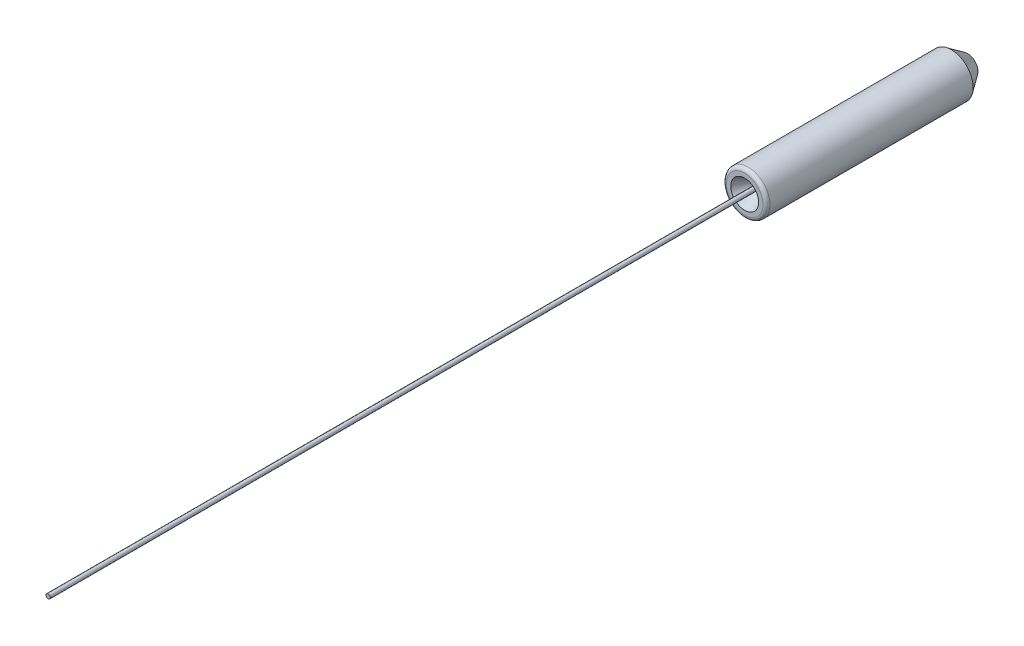
ISO-10303-21;
HEADER;
FILE_DESCRIPTION(('STEP AP214'),'2;1');
FILE_NAME('part.step','',(''),(''),'','','');
FILE_SCHEMA(('AUTOMOTIVE_DESIGN { 1 0 10303 214 1 1 1 1 }'));
ENDSEC;
DATA;
#1=APPLICATION_CONTEXT('core data for automotive mechanical design processes');
#2=APPLICATION_PROTOCOL_DEFINITION('international standard','automotive_design',2000,#1);
#3=PRODUCT_CONTEXT('',#1,'mechanical');
#4=PRODUCT('Part','Part','',(#3));
#5=PRODUCT_RELATED_PRODUCT_CATEGORY('part','',(#4));
#6=PRODUCT_DEFINITION_FORMATION('','',#4);
#7=PRODUCT_DEFINITION_CONTEXT('part definition',#1,'design');
#8=PRODUCT_DEFINITION('design','',#6,#7);
#9=PRODUCT_DEFINITION_SHAPE('','',#8);
#10=(LENGTH_UNIT() NAMED_UNIT(*) SI_UNIT(.MILLI.,.METRE.));
#11=(NAMED_UNIT(*) PLANE_ANGLE_UNIT() SI_UNIT($,.RADIAN.));
#12=(NAMED_UNIT(*) SI_UNIT($,.STERADIAN.) SOLID_ANGLE_UNIT());
#13=UNCERTAINTY_MEASURE_WITH_UNIT(LENGTH_MEASURE(1.E-05),#10,'distance_accuracy_value','');
#14=(GEOMETRIC_REPRESENTATION_CONTEXT(3) GLOBAL_UNCERTAINTY_ASSIGNED_CONTEXT((#13)) GLOBAL_UNIT_ASSIGNED_CONTEXT((#10,
#11,#12)) REPRESENTATION_CONTEXT('',''));
#15=CARTESIAN_POINT('',(0.,0.,0.));
#16=DIRECTION('',(0.,0.,1.));
#17=DIRECTION('',(1.,0.,0.));
#18=AXIS2_PLACEMENT_3D('',#15,#16,#17);
#19=CARTESIAN_POINT('',(0.,0.,-6.4));
#20=DIRECTION('',(0.,0.,1.));
#21=DIRECTION('',(1.,0.,0.));
#22=AXIS2_PLACEMENT_3D('',#19,#20,#21);
#23=CYLINDRICAL_SURFACE('',#22,0.0625);
#24=CARTESIAN_POINT('',(0.,0.,-6.4));
#25=DIRECTION('',(0.,0.,1.));
#26=DIRECTION('',(1.,0.,0.));
#27=AXIS2_PLACEMENT_3D('',#24,#25,#26);
#28=CIRCLE('',#27,0.0625);
#29=CARTESIAN_POINT('',(0.0625,0.,-6.4));
#30=VERTEX_POINT('',#29);
#31=EDGE_CURVE('P0_E10',#30,#30,#28,.T.);
#32=ORIENTED_EDGE('',*,*,#31,.T.);
#33=EDGE_LOOP('',(#32));
#34=FACE_BOUND('',#33,.T.);
#35=CARTESIAN_POINT('',(0.,0.,20.));
#36=DIRECTION('',(0.,0.,1.));
#37=DIRECTION('',(1.,0.,0.));
#38=AXIS2_PLACEMENT_3D('',#35,#36,#37);
#39=CIRCLE('',#38,0.0625);
#40=CARTESIAN_POINT('',(0.0625,0.,20.));
#41=VERTEX_POINT('',#40);
#42=EDGE_CURVE('P0_E17',#41,#41,#39,.T.);
#43=ORIENTED_EDGE('',*,*,#42,.F.);
#44=EDGE_LOOP('',(#43));
#45=FACE_BOUND('',#44,.T.);
#46=ADVANCED_FACE('P0_F14',(#34,#45),#23,.T.);
#47=CARTESIAN_POINT('',(0.,0.,-6.4));
#48=DIRECTION('',(0.,0.,1.));
#49=DIRECTION('',(1.,0.,0.));
#50=AXIS2_PLACEMENT_3D('',#47,#48,#49);
#51=PLANE('',#50);
#52=ORIENTED_EDGE('',*,*,#31,.F.);
#53=EDGE_LOOP('',(#52));
#54=FACE_BOUND('',#53,.T.);
#55=ADVANCED_FACE('P0_F29',(#54),#51,.F.);
#56=CARTESIAN_POINT('',(0.,0.,20.));
#57=DIRECTION('',(0.,0.,1.));
#58=DIRECTION('',(1.,0.,0.));
#59=AXIS2_PLACEMENT_3D('',#56,#57,#58);
#60=PLANE('',#59);
#61=ORIENTED_EDGE('',*,*,#42,.T.);
#62=EDGE_LOOP('',(#61));
#63=FACE_BOUND('',#62,.T.);
#64=ADVANCED_FACE('P0_F26',(#63),#60,.T.);
#65=CLOSED_SHELL('',(#46,#55,#64));
#66=MANIFOLD_SOLID_BREP('P0_B1',#65);
#67=CARTESIAN_POINT('',(0.,0.,-6.4));
#68=DIRECTION('',(0.,0.,1.));
#69=DIRECTION('',(1.,0.,0.));
#70=AXIS2_PLACEMENT_3D('',#67,#68,#69);
#71=CYLINDRICAL_SURFACE('',#70,0.6245);
#72=CARTESIAN_POINT('',(0.,0.,-0.1));
#73=DIRECTION('',(0.,0.,1.));
#74=DIRECTION('',(1.,0.,0.));
#75=AXIS2_PLACEMENT_3D('',#72,#73,#74);
#76=CIRCLE('',#75,0.6245);
#77=CARTESIAN_POINT('',(0.6245,0.,-0.1));
#78=VERTEX_POINT('',#77);
#79=EDGE_CURVE('P1_E9',#78,#78,#76,.F.);
#80=ORIENTED_EDGE('',*,*,#79,.T.);
#81=EDGE_LOOP('',(#80));
#82=FACE_BOUND('',#81,.T.);
#83=CARTESIAN_POINT('',(0.,0.,-5.93585189780881));
#84=DIRECTION('',(0.,0.,1.));
#85=DIRECTION('',(1.,0.,0.));
#86=AXIS2_PLACEMENT_3D('',#83,#84,#85);
#87=CIRCLE('',#86,0.6245);
#88=CARTESIAN_POINT('',(0.6245,0.,-5.93585189780881));
#89=VERTEX_POINT('',#88);
#90=EDGE_CURVE('P1_E28',#89,#89,#87,.T.);
#91=ORIENTED_EDGE('',*,*,#90,.T.);
#92=EDGE_LOOP('',(#91));
#93=FACE_BOUND('',#92,.T.);
#94=ADVANCED_FACE('P1_F13',(#82,#93),#71,.T.);
#95=CARTESIAN_POINT('',(0.,0.,-6.4));
#96=DIRECTION('',(0.,0.,1.));
#97=DIRECTION('',(1.,0.,0.));
#98=AXIS2_PLACEMENT_3D('',#95,#96,#97);
#99=PLANE('',#98);
#100=CARTESIAN_POINT('',(0.,0.,-6.4));
#101=DIRECTION('',(0.,0.,1.));
#102=DIRECTION('',(1.,0.,0.));
#103=AXIS2_PLACEMENT_3D('',#100,#101,#102);
#104=CIRCLE('',#103,0.299499999999999);
#105=CARTESIAN_POINT('',(0.299499999999999,0.,-6.4));
#106=VERTEX_POINT('',#105);
#107=EDGE_CURVE('P1_E24',#106,#106,#104,.F.);
#108=ORIENTED_EDGE('',*,*,#107,.T.);
#109=EDGE_LOOP('',(#108));
#110=FACE_BOUND('',#109,.T.);
#111=CARTESIAN_POINT('',(0.,0.,-6.4));
#112=DIRECTION('',(0.,0.,-1.));
#113=DIRECTION('',(-1.,0.,0.));
#114=AXIS2_PLACEMENT_3D('',#111,#112,#113);
#115=CIRCLE('',#114,0.063);
#116=CARTESIAN_POINT('',(-0.063,0.,-6.4));
#117=VERTEX_POINT('',#116);
#118=EDGE_CURVE('P1_E42',#117,#117,#115,.T.);
#119=ORIENTED_EDGE('',*,*,#118,.F.);
#120=EDGE_LOOP('',(#119));
#121=FACE_BOUND('',#120,.T.);
#122=ADVANCED_FACE('P1_F48',(#110,#121),#99,.F.);
#123=CARTESIAN_POINT('',(0.,0.,0.));
#124=DIRECTION('',(0.,0.,1.));
#125=DIRECTION('',(1.,0.,0.));
#126=AXIS2_PLACEMENT_3D('',#123,#124,#125);
#127=PLANE('',#126);
#128=CARTESIAN_POINT('',(0.,0.,0.));
#129=DIRECTION('',(0.,0.,1.));
#130=DIRECTION('',(1.,0.,0.));
#131=AXIS2_PLACEMENT_3D('',#128,#129,#130);
#132=CIRCLE('',#131,0.5245);
#133=CARTESIAN_POINT('',(0.5245,0.,0.));
#134=VERTEX_POINT('',#133);
#135=EDGE_CURVE('P1_E20',#134,#134,#132,.T.);
#136=ORIENTED_EDGE('',*,*,#135,.T.);
#137=EDGE_LOOP('',(#136));
#138=FACE_BOUND('',#137,.T.);
#139=CARTESIAN_POINT('',(0.,0.,0.));
#140=DIRECTION('',(0.,0.,-1.));
#141=DIRECTION('',(-1.,0.,0.));
#142=AXIS2_PLACEMENT_3D('',#139,#140,#141);
#143=CIRCLE('',#142,0.4);
#144=CARTESIAN_POINT('',(-0.4,0.,0.));
#145=VERTEX_POINT('',#144);
#146=EDGE_CURVE('P1_E33',#145,#145,#143,.T.);
#147=ORIENTED_EDGE('',*,*,#146,.T.);
#148=EDGE_LOOP('',(#147));
#149=FACE_BOUND('',#148,.T.);
#150=ADVANCED_FACE('P1_F50',(#138,#149),#127,.T.);
#151=CARTESIAN_POINT('',(0.,0.,-0.537290960636936));
#152=DIRECTION('',(0.,0.,1.));
#153=DIRECTION('',(1.,0.,0.));
#154=AXIS2_PLACEMENT_3D('',#151,#152,#153);
#155=CONICAL_SURFACE('',#154,0.0897949192431117,0.5235987755983);
#156=ORIENTED_EDGE('',*,*,#146,.F.);
#157=EDGE_LOOP('',(#156));
#158=FACE_BOUND('',#157,.T.);
#159=CARTESIAN_POINT('',(0.,0.,-0.537290960636936));
#160=DIRECTION('',(0.,0.,-1.));
#161=DIRECTION('',(-1.,0.,0.));
#162=AXIS2_PLACEMENT_3D('',#159,#160,#161);
#163=CIRCLE('',#162,0.0897949192431117);
#164=CARTESIAN_POINT('',(-0.0897949192431117,0.,-0.537290960636936));
#165=VERTEX_POINT('',#164);
#166=EDGE_CURVE('P1_E36',#165,#165,#163,.T.);
#167=ORIENTED_EDGE('',*,*,#166,.T.);
#168=EDGE_LOOP('',(#167));
#169=FACE_BOUND('',#168,.T.);
#170=ADVANCED_FACE('P1_F58',(#158,#169),#155,.F.);
#171=CARTESIAN_POINT('',(0.,0.,-0.637290960636936));
#172=DIRECTION('',(0.,0.,-1.));
#173=DIRECTION('',(-1.,0.,0.));
#174=AXIS2_PLACEMENT_3D('',#171,#172,#173);
#175=TOROIDAL_SURFACE('',#174,0.262999999999999,0.2);
#176=ORIENTED_EDGE('',*,*,#166,.F.);
#177=EDGE_LOOP('',(#176));
#178=FACE_BOUND('',#177,.T.);
#179=CARTESIAN_POINT('',(0.,0.,-0.637290960636937));
#180=DIRECTION('',(0.,0.,-1.));
#181=DIRECTION('',(-1.,0.,0.));
#182=AXIS2_PLACEMENT_3D('',#179,#180,#181);
#183=CIRCLE('',#182,0.0629999999999993);
#184=CARTESIAN_POINT('',(-0.0629999999999993,0.,-0.637290960636937));
#185=VERTEX_POINT('',#184);
#186=EDGE_CURVE('P1_E39',#185,#185,#183,.T.);
#187=ORIENTED_EDGE('',*,*,#186,.T.);
#188=EDGE_LOOP('',(#187));
#189=FACE_BOUND('',#188,.T.);
#190=ADVANCED_FACE('P1_F71',(#178,#189),#175,.T.);
#191=CARTESIAN_POINT('',(0.,0.,-13.136975719544));
#192=DIRECTION('',(0.,0.,-1.));
#193=DIRECTION('',(-1.,0.,0.));
#194=AXIS2_PLACEMENT_3D('',#191,#192,#193);
#195=CYLINDRICAL_SURFACE('',#194,0.0629999999999997);
#196=ORIENTED_EDGE('',*,*,#186,.F.);
#197=EDGE_LOOP('',(#196));
#198=FACE_BOUND('',#197,.T.);
#199=ORIENTED_EDGE('',*,*,#118,.T.);
#200=EDGE_LOOP('',(#199));
#201=FACE_BOUND('',#200,.T.);
#202=ADVANCED_FACE('P1_F46',(#198,#201),#195,.F.);
#203=CARTESIAN_POINT('',(0.,0.,-5.93585189780881));
#204=DIRECTION('',(0.,0.,1.));
#205=DIRECTION('',(1.,0.,0.));
#206=AXIS2_PLACEMENT_3D('',#203,#204,#205);
#207=CONICAL_SURFACE('',#206,0.6245,0.610865238198017);
#208=ORIENTED_EDGE('',*,*,#107,.F.);
#209=EDGE_LOOP('',(#208));
#210=FACE_BOUND('',#209,.T.);
#211=ORIENTED_EDGE('',*,*,#90,.F.);
#212=EDGE_LOOP('',(#211));
#213=FACE_BOUND('',#212,.T.);
#214=ADVANCED_FACE('P1_F63',(#210,#213),#207,.T.);
#215=CARTESIAN_POINT('',(0.,0.,-0.1));
#216=DIRECTION('',(0.,0.,1.));
#217=DIRECTION('',(1.,0.,0.));
#218=AXIS2_PLACEMENT_3D('',#215,#216,#217);
#219=TOROIDAL_SURFACE('',#218,0.5245,0.1);
#220=ORIENTED_EDGE('',*,*,#79,.F.);
#221=EDGE_LOOP('',(#220));
#222=FACE_BOUND('',#221,.T.);
#223=ORIENTED_EDGE('',*,*,#135,.F.);
#224=EDGE_LOOP('',(#223));
#225=FACE_BOUND('',#224,.T.);
#226=ADVANCED_FACE('P1_F15',(#222,#225),#219,.T.);
#227=CLOSED_SHELL('',(#94,#122,#150,#170,#190,#202,#214,#226));
#228=MANIFOLD_SOLID_BREP('P1_B1',#227);
#229=ADVANCED_BREP_SHAPE_REPRESENTATION('',(#18,#66,#228),#14);
#230=SHAPE_DEFINITION_REPRESENTATION(#9,#229);
ENDSEC;
END-ISO-10303-21;
